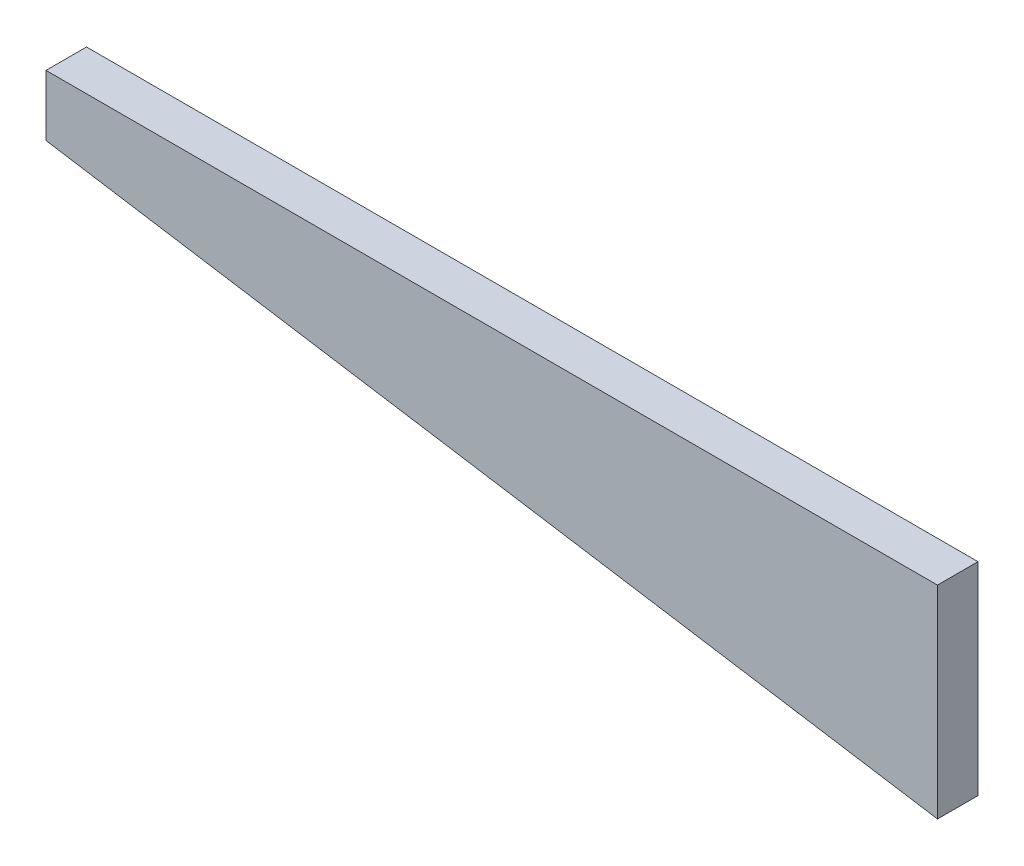
ISO-10303-21;
HEADER;
FILE_DESCRIPTION(('STEP AP214'),'2;1');
FILE_NAME('part.step','',(''),(''),'','','');
FILE_SCHEMA(('AUTOMOTIVE_DESIGN { 1 0 10303 214 1 1 1 1 }'));
ENDSEC;
DATA;
#1=APPLICATION_CONTEXT('core data for automotive mechanical design processes');
#2=APPLICATION_PROTOCOL_DEFINITION('international standard','automotive_design',2000,#1);
#3=PRODUCT_CONTEXT('',#1,'mechanical');
#4=PRODUCT('Part','Part','',(#3));
#5=PRODUCT_RELATED_PRODUCT_CATEGORY('part','',(#4));
#6=PRODUCT_DEFINITION_FORMATION('','',#4);
#7=PRODUCT_DEFINITION_CONTEXT('part definition',#1,'design');
#8=PRODUCT_DEFINITION('design','',#6,#7);
#9=PRODUCT_DEFINITION_SHAPE('','',#8);
#10=(LENGTH_UNIT() NAMED_UNIT(*) SI_UNIT(.MILLI.,.METRE.));
#11=(NAMED_UNIT(*) PLANE_ANGLE_UNIT() SI_UNIT($,.RADIAN.));
#12=(NAMED_UNIT(*) SI_UNIT($,.STERADIAN.) SOLID_ANGLE_UNIT());
#13=UNCERTAINTY_MEASURE_WITH_UNIT(LENGTH_MEASURE(1.E-05),#10,'distance_accuracy_value','');
#14=(GEOMETRIC_REPRESENTATION_CONTEXT(3) GLOBAL_UNCERTAINTY_ASSIGNED_CONTEXT((#13)) GLOBAL_UNIT_ASSIGNED_CONTEXT((#10,
#11,#12)) REPRESENTATION_CONTEXT('',''));
#15=CARTESIAN_POINT('',(0.,0.,0.));
#16=DIRECTION('',(0.,0.,1.));
#17=DIRECTION('',(1.,0.,0.));
#18=AXIS2_PLACEMENT_3D('',#15,#16,#17);
#19=CARTESIAN_POINT('',(-220.,35.,5.));
#20=DIRECTION('',(0.157115048735132,0.987580306335114,0.));
#21=DIRECTION('',(-0.987580306335114,0.157115048735132,0.));
#22=AXIS2_PLACEMENT_3D('',#19,#20,#21);
#23=PLANE('',#22);
#24=DIRECTION('',(0.987580306335114,-0.157115048735132,0.));
#25=VECTOR('',#24,1.);
#26=CARTESIAN_POINT('',(-220.,35.,-5.));
#27=LINE('',#26,#25);
#28=CARTESIAN_POINT('',(-220.,35.,-5.));
#29=VERTEX_POINT('',#28);
#30=CARTESIAN_POINT('',(0.,0.,-5.));
#31=VERTEX_POINT('',#30);
#32=EDGE_CURVE('E97',#29,#31,#27,.T.);
#33=ORIENTED_EDGE('',*,*,#32,.T.);
#34=DIRECTION('',(0.,0.,-1.));
#35=VECTOR('',#34,1.);
#36=CARTESIAN_POINT('',(0.,0.,5.));
#37=LINE('',#36,#35);
#38=CARTESIAN_POINT('',(0.,0.,5.));
#39=VERTEX_POINT('',#38);
#40=EDGE_CURVE('E11',#39,#31,#37,.T.);
#41=ORIENTED_EDGE('',*,*,#40,.F.);
#42=DIRECTION('',(0.987580306335114,-0.157115048735132,0.));
#43=VECTOR('',#42,1.);
#44=CARTESIAN_POINT('',(-220.,35.,5.));
#45=LINE('',#44,#43);
#46=CARTESIAN_POINT('',(-220.,35.,5.));
#47=VERTEX_POINT('',#46);
#48=EDGE_CURVE('E85',#47,#39,#45,.T.);
#49=ORIENTED_EDGE('',*,*,#48,.F.);
#50=DIRECTION('',(0.,0.,-1.));
#51=VECTOR('',#50,1.);
#52=CARTESIAN_POINT('',(-220.,35.,5.));
#53=LINE('',#52,#51);
#54=EDGE_CURVE('E93',#47,#29,#53,.T.);
#55=ORIENTED_EDGE('',*,*,#54,.T.);
#56=EDGE_LOOP('',(#33,#41,#49,#55));
#57=FACE_BOUND('',#56,.T.);
#58=ADVANCED_FACE('F34',(#57),#23,.F.);
#59=CARTESIAN_POINT('',(0.,0.,5.));
#60=DIRECTION('',(-1.,0.,0.));
#61=DIRECTION('',(0.,0.,1.));
#62=AXIS2_PLACEMENT_3D('',#59,#60,#61);
#63=PLANE('',#62);
#64=DIRECTION('',(0.,1.,0.));
#65=VECTOR('',#64,1.);
#66=CARTESIAN_POINT('',(0.,0.,-5.));
#67=LINE('',#66,#65);
#68=CARTESIAN_POINT('',(0.,50.,-5.));
#69=VERTEX_POINT('',#68);
#70=EDGE_CURVE('E89',#31,#69,#67,.T.);
#71=ORIENTED_EDGE('',*,*,#70,.T.);
#72=DIRECTION('',(0.,0.,-1.));
#73=VECTOR('',#72,1.);
#74=CARTESIAN_POINT('',(0.,50.,5.));
#75=LINE('',#74,#73);
#76=CARTESIAN_POINT('',(0.,50.,5.));
#77=VERTEX_POINT('',#76);
#78=EDGE_CURVE('E42',#77,#69,#75,.T.);
#79=ORIENTED_EDGE('',*,*,#78,.F.);
#80=DIRECTION('',(0.,1.,0.));
#81=VECTOR('',#80,1.);
#82=CARTESIAN_POINT('',(0.,0.,5.));
#83=LINE('',#82,#81);
#84=EDGE_CURVE('E80',#39,#77,#83,.T.);
#85=ORIENTED_EDGE('',*,*,#84,.F.);
#86=ORIENTED_EDGE('',*,*,#40,.T.);
#87=EDGE_LOOP('',(#71,#79,#85,#86));
#88=FACE_BOUND('',#87,.T.);
#89=ADVANCED_FACE('F88',(#88),#63,.F.);
#90=CARTESIAN_POINT('',(0.,50.,5.));
#91=DIRECTION('',(0.,-1.,0.));
#92=DIRECTION('',(1.,0.,0.));
#93=AXIS2_PLACEMENT_3D('',#90,#91,#92);
#94=PLANE('',#93);
#95=DIRECTION('',(-1.,0.,0.));
#96=VECTOR('',#95,1.);
#97=CARTESIAN_POINT('',(0.,50.,-5.));
#98=LINE('',#97,#96);
#99=CARTESIAN_POINT('',(-220.,50.,-5.));
#100=VERTEX_POINT('',#99);
#101=EDGE_CURVE('E67',#69,#100,#98,.T.);
#102=ORIENTED_EDGE('',*,*,#101,.T.);
#103=DIRECTION('',(0.,0.,-1.));
#104=VECTOR('',#103,1.);
#105=CARTESIAN_POINT('',(-220.,50.,5.));
#106=LINE('',#105,#104);
#107=CARTESIAN_POINT('',(-220.,50.,5.));
#108=VERTEX_POINT('',#107);
#109=EDGE_CURVE('E90',#108,#100,#106,.T.);
#110=ORIENTED_EDGE('',*,*,#109,.F.);
#111=DIRECTION('',(-1.,0.,0.));
#112=VECTOR('',#111,1.);
#113=CARTESIAN_POINT('',(0.,50.,5.));
#114=LINE('',#113,#112);
#115=EDGE_CURVE('E83',#77,#108,#114,.T.);
#116=ORIENTED_EDGE('',*,*,#115,.F.);
#117=ORIENTED_EDGE('',*,*,#78,.T.);
#118=EDGE_LOOP('',(#102,#110,#116,#117));
#119=FACE_BOUND('',#118,.T.);
#120=ADVANCED_FACE('F91',(#119),#94,.F.);
#121=CARTESIAN_POINT('',(-220.,50.,5.));
#122=DIRECTION('',(1.,0.,0.));
#123=DIRECTION('',(0.,0.,-1.));
#124=AXIS2_PLACEMENT_3D('',#121,#122,#123);
#125=PLANE('',#124);
#126=DIRECTION('',(0.,-1.,0.));
#127=VECTOR('',#126,1.);
#128=CARTESIAN_POINT('',(-220.,50.,-5.));
#129=LINE('',#128,#127);
#130=EDGE_CURVE('E73',#100,#29,#129,.T.);
#131=ORIENTED_EDGE('',*,*,#130,.T.);
#132=ORIENTED_EDGE('',*,*,#54,.F.);
#133=DIRECTION('',(0.,-1.,0.));
#134=VECTOR('',#133,1.);
#135=CARTESIAN_POINT('',(-220.,50.,5.));
#136=LINE('',#135,#134);
#137=EDGE_CURVE('E50',#108,#47,#136,.T.);
#138=ORIENTED_EDGE('',*,*,#137,.F.);
#139=ORIENTED_EDGE('',*,*,#109,.T.);
#140=EDGE_LOOP('',(#131,#132,#138,#139));
#141=FACE_BOUND('',#140,.T.);
#142=ADVANCED_FACE('F104',(#141),#125,.F.);
#143=CARTESIAN_POINT('',(0.,0.,5.));
#144=DIRECTION('',(0.,0.,1.));
#145=DIRECTION('',(1.,0.,0.));
#146=AXIS2_PLACEMENT_3D('',#143,#144,#145);
#147=PLANE('',#146);
#148=ORIENTED_EDGE('',*,*,#48,.T.);
#149=ORIENTED_EDGE('',*,*,#84,.T.);
#150=ORIENTED_EDGE('',*,*,#115,.T.);
#151=ORIENTED_EDGE('',*,*,#137,.T.);
#152=EDGE_LOOP('',(#148,#149,#150,#151));
#153=FACE_BOUND('',#152,.T.);
#154=ADVANCED_FACE('F81',(#153),#147,.T.);
#155=CARTESIAN_POINT('',(0.,0.,-5.));
#156=DIRECTION('',(0.,0.,1.));
#157=DIRECTION('',(1.,0.,0.));
#158=AXIS2_PLACEMENT_3D('',#155,#156,#157);
#159=PLANE('',#158);
#160=ORIENTED_EDGE('',*,*,#32,.F.);
#161=ORIENTED_EDGE('',*,*,#130,.F.);
#162=ORIENTED_EDGE('',*,*,#101,.F.);
#163=ORIENTED_EDGE('',*,*,#70,.F.);
#164=EDGE_LOOP('',(#160,#161,#162,#163));
#165=FACE_BOUND('',#164,.T.);
#166=ADVANCED_FACE('F107',(#165),#159,.F.);
#167=CLOSED_SHELL('',(#58,#89,#120,#142,#154,#166));
#168=MANIFOLD_SOLID_BREP('B2',#167);
#169=ADVANCED_BREP_SHAPE_REPRESENTATION('',(#18,#168),#14);
#170=SHAPE_DEFINITION_REPRESENTATION(#9,#169);
ENDSEC;
END-ISO-10303-21;
